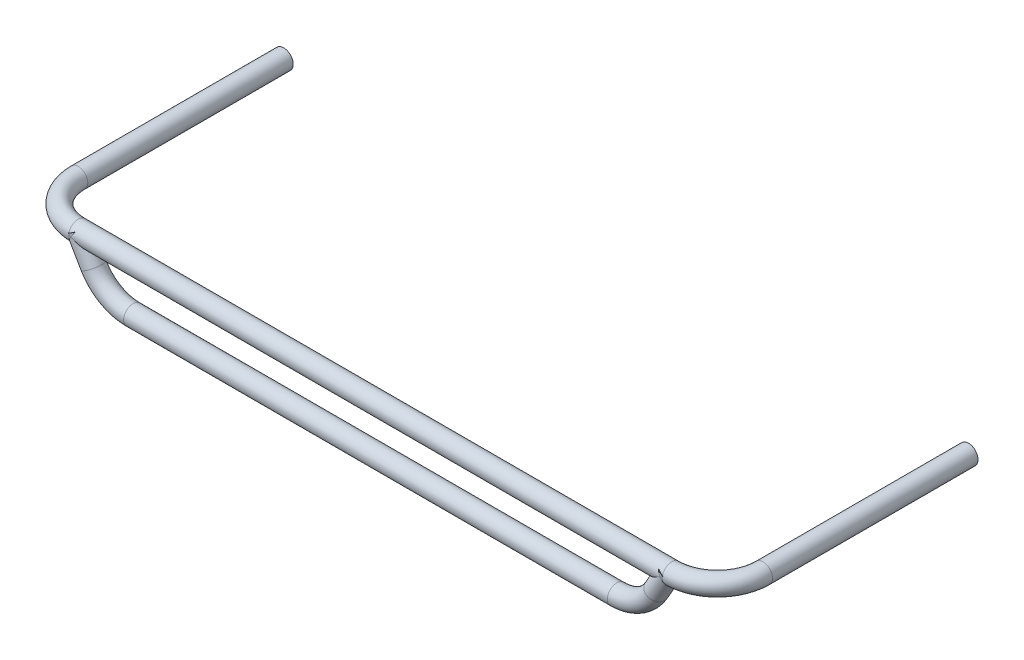
ISO-10303-21;
HEADER;
FILE_DESCRIPTION(('STEP AP214'),'2;1');
FILE_NAME('part.step','',(''),(''),'','','');
FILE_SCHEMA(('AUTOMOTIVE_DESIGN { 1 0 10303 214 1 1 1 1 }'));
ENDSEC;
DATA;
#1=APPLICATION_CONTEXT('core data for automotive mechanical design processes');
#2=APPLICATION_PROTOCOL_DEFINITION('international standard','automotive_design',2000,#1);
#3=PRODUCT_CONTEXT('',#1,'mechanical');
#4=PRODUCT('Part','Part','',(#3));
#5=PRODUCT_RELATED_PRODUCT_CATEGORY('part','',(#4));
#6=PRODUCT_DEFINITION_FORMATION('','',#4);
#7=PRODUCT_DEFINITION_CONTEXT('part definition',#1,'design');
#8=PRODUCT_DEFINITION('design','',#6,#7);
#9=PRODUCT_DEFINITION_SHAPE('','',#8);
#10=(LENGTH_UNIT() NAMED_UNIT(*) SI_UNIT(.MILLI.,.METRE.));
#11=(NAMED_UNIT(*) PLANE_ANGLE_UNIT() SI_UNIT($,.RADIAN.));
#12=(NAMED_UNIT(*) SI_UNIT($,.STERADIAN.) SOLID_ANGLE_UNIT());
#13=UNCERTAINTY_MEASURE_WITH_UNIT(LENGTH_MEASURE(1.E-05),#10,'distance_accuracy_value','');
#14=(GEOMETRIC_REPRESENTATION_CONTEXT(3) GLOBAL_UNCERTAINTY_ASSIGNED_CONTEXT((#13)) GLOBAL_UNIT_ASSIGNED_CONTEXT((#10,
#11,#12)) REPRESENTATION_CONTEXT('',''));
#15=CARTESIAN_POINT('',(0.,0.,0.));
#16=DIRECTION('',(0.,0.,1.));
#17=DIRECTION('',(1.,0.,0.));
#18=AXIS2_PLACEMENT_3D('',#15,#16,#17);
#19=CARTESIAN_POINT('',(-260.,0.,140.));
#20=DIRECTION('',(1.,0.,0.));
#21=DIRECTION('',(0.,0.,-1.));
#22=AXIS2_PLACEMENT_3D('',#19,#20,#21);
#23=CYLINDRICAL_SURFACE('',#22,8.35000000000005);
#24=CARTESIAN_POINT('',(258.094010767585,0.,140.));
#25=DIRECTION('',(0.500000000000002,-0.866025403784438,0.));
#26=DIRECTION('',(0.866025403784438,0.500000000000002,0.));
#27=AXIS2_PLACEMENT_3D('',#24,#25,#26);
#28=ELLIPSE('',#27,16.6999999999999,8.35);
#29=CARTESIAN_POINT('',(259.999999999976,1.10042339639402,131.722828481379));
#30=VERTEX_POINT('',#29);
#31=CARTESIAN_POINT('',(258.094010767585,0.,131.65));
#32=VERTEX_POINT('',#31);
#33=EDGE_CURVE('E141',#30,#32,#28,.F.);
#34=ORIENTED_EDGE('',*,*,#33,.F.);
#35=CARTESIAN_POINT('',(260.,0.,140.));
#36=DIRECTION('',(-1.,0.,0.));
#37=DIRECTION('',(0.,0.,1.));
#38=AXIS2_PLACEMENT_3D('',#35,#36,#37);
#39=CIRCLE('',#38,8.35000000000005);
#40=CARTESIAN_POINT('',(260.,-3.30127018922277,132.330311926959));
#41=VERTEX_POINT('',#40);
#42=EDGE_CURVE('E272',#30,#41,#39,.T.);
#43=ORIENTED_EDGE('',*,*,#42,.T.);
#44=CARTESIAN_POINT('',(258.094010767585,0.,140.));
#45=DIRECTION('',(0.866025403784438,0.500000000000002,0.));
#46=DIRECTION('',(0.500000000000002,-0.866025403784438,0.));
#47=AXIS2_PLACEMENT_3D('',#44,#45,#46);
#48=ELLIPSE('',#47,9.64174949546676,8.35);
#49=EDGE_CURVE('E157',#32,#41,#48,.F.);
#50=ORIENTED_EDGE('',*,*,#49,.F.);
#51=EDGE_LOOP('',(#34,#43,#50));
#52=FACE_BOUND('',#51,.T.);
#53=ADVANCED_FACE('F36',(#52),#23,.T.);
#54=CARTESIAN_POINT('',(258.094010767585,0.,148.35));
#55=VERTEX_POINT('',#54);
#56=CARTESIAN_POINT('',(259.999999999995,1.10042339640476,148.27717151862));
#57=VERTEX_POINT('',#56);
#58=EDGE_CURVE('E169',#55,#57,#28,.F.);
#59=ORIENTED_EDGE('',*,*,#58,.F.);
#60=CARTESIAN_POINT('',(260.,-3.30127018922279,147.669688073041));
#61=VERTEX_POINT('',#60);
#62=EDGE_CURVE('E159',#61,#55,#48,.F.);
#63=ORIENTED_EDGE('',*,*,#62,.F.);
#64=EDGE_CURVE('E269',#61,#57,#39,.T.);
#65=ORIENTED_EDGE('',*,*,#64,.T.);
#66=EDGE_LOOP('',(#59,#63,#65));
#67=FACE_BOUND('',#66,.T.);
#68=ADVANCED_FACE('F311',(#67),#23,.T.);
#69=CARTESIAN_POINT('',(-258.094010767585,0.,140.));
#70=DIRECTION('',(0.499999999999998,0.86602540378444,0.));
#71=DIRECTION('',(0.86602540378444,-0.499999999999998,0.));
#72=AXIS2_PLACEMENT_3D('',#69,#70,#71);
#73=ELLIPSE('',#72,16.7000000000001,8.35000000000001);
#74=CARTESIAN_POINT('',(-258.094010767585,0.,148.35));
#75=VERTEX_POINT('',#74);
#76=CARTESIAN_POINT('',(-258.094010767585,0.,131.65));
#77=VERTEX_POINT('',#76);
#78=EDGE_CURVE('E56',#75,#77,#73,.T.);
#79=ORIENTED_EDGE('',*,*,#78,.T.);
#80=CARTESIAN_POINT('',(-258.094010767585,0.,140.));
#81=DIRECTION('',(0.86602540378444,-0.499999999999997,0.));
#82=DIRECTION('',(0.499999999999997,0.86602540378444,0.));
#83=AXIS2_PLACEMENT_3D('',#80,#81,#82);
#84=ELLIPSE('',#83,9.64174949546677,8.35000000000003);
#85=CARTESIAN_POINT('',(-255.575509316577,4.36217247208265,132.88003150823));
#86=VERTEX_POINT('',#85);
#87=EDGE_CURVE('E235',#86,#77,#84,.F.);
#88=ORIENTED_EDGE('',*,*,#87,.F.);
#89=CARTESIAN_POINT('',(-263.131013669602,0.,140.));
#90=DIRECTION('',(-0.500000000000005,0.866025403784436,0.));
#91=DIRECTION('',(0.866025403784436,0.500000000000005,0.));
#92=AXIS2_PLACEMENT_3D('',#89,#90,#91);
#93=ELLIPSE('',#92,16.6999999999999,8.35000000000005);
#94=CARTESIAN_POINT('',(-260.,1.80769158498116,131.848021642964));
#95=VERTEX_POINT('',#94);
#96=EDGE_CURVE('E248',#86,#95,#93,.T.);
#97=ORIENTED_EDGE('',*,*,#96,.T.);
#98=CARTESIAN_POINT('',(-260.,0.,140.));
#99=DIRECTION('',(-1.,0.,0.));
#100=DIRECTION('',(0.,0.,1.));
#101=AXIS2_PLACEMENT_3D('',#98,#99,#100);
#102=CIRCLE('',#101,8.35000000000005);
#103=CARTESIAN_POINT('',(-260.,1.80769158498116,148.151978357036));
#104=VERTEX_POINT('',#103);
#105=EDGE_CURVE('E268',#104,#95,#102,.T.);
#106=ORIENTED_EDGE('',*,*,#105,.F.);
#107=CARTESIAN_POINT('',(-255.575509316577,4.36217247208266,147.11996849177));
#108=VERTEX_POINT('',#107);
#109=EDGE_CURVE('E245',#104,#108,#93,.T.);
#110=ORIENTED_EDGE('',*,*,#109,.T.);
#111=EDGE_CURVE('E237',#75,#108,#84,.F.);
#112=ORIENTED_EDGE('',*,*,#111,.F.);
#113=EDGE_LOOP('',(#79,#88,#97,#106,#110,#112));
#114=FACE_BOUND('',#113,.T.);
#115=CARTESIAN_POINT('',(258.094010767585,0.,140.));
#116=DIRECTION('',(0.866025403784438,0.500000000000002,0.));
#117=DIRECTION('',(0.500000000000002,-0.866025403784438,0.));
#118=AXIS2_PLACEMENT_3D('',#115,#116,#117);
#119=ELLIPSE('',#118,9.64174949546676,8.35);
#120=CARTESIAN_POINT('',(255.575509316577,4.36217247208224,132.880031508229));
#121=VERTEX_POINT('',#120);
#122=EDGE_CURVE('E156',#32,#121,#119,.T.);
#123=ORIENTED_EDGE('',*,*,#122,.F.);
#124=CARTESIAN_POINT('',(258.094010767585,0.,140.));
#125=DIRECTION('',(0.500000000000002,-0.866025403784438,0.));
#126=DIRECTION('',(0.866025403784438,0.500000000000002,0.));
#127=AXIS2_PLACEMENT_3D('',#124,#125,#126);
#128=ELLIPSE('',#127,16.7,8.35000000000001);
#129=EDGE_CURVE('E155',#32,#55,#128,.F.);
#130=ORIENTED_EDGE('',*,*,#129,.T.);
#131=CARTESIAN_POINT('',(255.575509316577,4.36217247208215,147.119968491771));
#132=VERTEX_POINT('',#131);
#133=EDGE_CURVE('E146',#132,#55,#119,.T.);
#134=ORIENTED_EDGE('',*,*,#133,.F.);
#135=CARTESIAN_POINT('',(263.131013669602,0.,140.));
#136=DIRECTION('',(0.499999999999996,0.866025403784441,0.));
#137=DIRECTION('',(0.866025403784441,-0.499999999999996,0.));
#138=AXIS2_PLACEMENT_3D('',#135,#136,#137);
#139=ELLIPSE('',#138,16.7000000000002,8.35000000000005);
#140=CARTESIAN_POINT('',(260.,1.80769158498089,148.151978357036));
#141=VERTEX_POINT('',#140);
#142=EDGE_CURVE('E131',#132,#141,#139,.T.);
#143=ORIENTED_EDGE('',*,*,#142,.T.);
#144=CARTESIAN_POINT('',(260.,1.80769158498089,131.848021642964));
#145=VERTEX_POINT('',#144);
#146=EDGE_CURVE('E273',#141,#145,#39,.T.);
#147=ORIENTED_EDGE('',*,*,#146,.T.);
#148=EDGE_CURVE('E140',#145,#121,#139,.T.);
#149=ORIENTED_EDGE('',*,*,#148,.T.);
#150=EDGE_LOOP('',(#123,#130,#134,#143,#147,#149));
#151=FACE_BOUND('',#150,.T.);
#152=ADVANCED_FACE('F154',(#114,#151),#23,.T.);
#153=CARTESIAN_POINT('',(260.,0.,100.));
#154=DIRECTION('',(0.,1.,0.));
#155=DIRECTION('',(0.,0.,1.));
#156=AXIS2_PLACEMENT_3D('',#153,#154,#155);
#157=TOROIDAL_SURFACE('',#156,40.,8.35000000000005);
#158=CARTESIAN_POINT('',(300.,0.,99.9999999999999));
#159=DIRECTION('',(0.,0.,1.));
#160=DIRECTION('',(1.,0.,0.));
#161=AXIS2_PLACEMENT_3D('',#158,#159,#160);
#162=CIRCLE('',#161,8.35000000000005);
#163=CARTESIAN_POINT('',(308.35,0.,99.9999999999999));
#164=VERTEX_POINT('',#163);
#165=EDGE_CURVE('E274',#164,#164,#162,.T.);
#166=ORIENTED_EDGE('',*,*,#165,.T.);
#167=EDGE_LOOP('',(#166));
#168=FACE_BOUND('',#167,.T.);
#169=CARTESIAN_POINT('',(259.9998,-3.30092378193599,132.330162831237));
#170=CARTESIAN_POINT('',(260.127191042265,-3.52194896573577,132.425241184169));
#171=CARTESIAN_POINT('',(260.251656278802,-3.7405873813507,132.529953859329));
#172=CARTESIAN_POINT('',(260.494955624184,-4.17100374883151,132.758747523321));
#173=CARTESIAN_POINT('',(260.613785352044,-4.38277632408056,132.882843268724));
#174=CARTESIAN_POINT('',(260.846802336749,-4.79874757524487,133.151467128787));
#175=CARTESIAN_POINT('',(260.960942892945,-5.002868829025,133.296156233047));
#176=CARTESIAN_POINT('',(261.182895743755,-5.39946088372897,133.604988661169));
#177=CARTESIAN_POINT('',(261.290709380227,-5.59193415531237,133.769127837462));
#178=CARTESIAN_POINT('',(261.499735660655,-5.96400988069852,134.117421014595));
#179=CARTESIAN_POINT('',(261.600911311754,-6.1435406786224,134.301674066792));
#180=CARTESIAN_POINT('',(261.794968483451,-6.48632252344461,134.688841917994));
#181=CARTESIAN_POINT('',(261.887849277702,-6.64957214481551,134.891758348119));
#182=CARTESIAN_POINT('',(262.06376042126,-6.9568858981134,135.314439468037));
#183=CARTESIAN_POINT('',(262.14682370751,-7.10101439146055,135.534143500346));
#184=CARTESIAN_POINT('',(262.302139027113,-7.3684429881502,135.98946784453));
#185=CARTESIAN_POINT('',(262.374393456754,-7.49174770883678,136.225084611742));
#186=CARTESIAN_POINT('',(262.497635276804,-7.69999139493781,136.676705268877));
#187=CARTESIAN_POINT('',(262.550181471088,-7.78787650773961,136.890929820182));
#188=CARTESIAN_POINT('',(262.64546072037,-7.94543811651955,137.328075966104));
#189=CARTESIAN_POINT('',(262.688195142735,-8.01511714988097,137.5509963438));
#190=CARTESIAN_POINT('',(262.76314145715,-8.13531904491372,138.003668991271));
#191=CARTESIAN_POINT('',(262.795353527362,-8.18584223093298,138.233421145301));
#192=CARTESIAN_POINT('',(262.84867590119,-8.26706237333086,138.69766551197));
#193=CARTESIAN_POINT('',(262.869787250017,-8.29776119637363,138.932157276183));
#194=CARTESIAN_POINT('',(262.898661018409,-8.33652083501706,139.375306170574));
#195=CARTESIAN_POINT('',(262.907722074794,-8.34685756587417,139.583683947074));
#196=CARTESIAN_POINT('',(262.916789533394,-8.35191293856676,140.000821222853));
#197=CARTESIAN_POINT('',(262.916796403656,-8.34663238773406,140.209580701842));
#198=CARTESIAN_POINT('',(262.907725107887,-8.32063930912101,140.625864727206));
#199=CARTESIAN_POINT('',(262.898649832772,-8.29993169242908,140.833389645405));
#200=CARTESIAN_POINT('',(262.871505334329,-8.24345502241763,141.245783819159));
#201=CARTESIAN_POINT('',(262.853435931941,-8.20768566924366,141.450653021758));
#202=CARTESIAN_POINT('',(262.808892291563,-8.12236149948406,141.852778396806));
#203=CARTESIAN_POINT('',(262.782570317973,-8.07305829388492,142.050105038437));
#204=CARTESIAN_POINT('',(262.72170008017,-7.96101661456943,142.439671105707));
#205=CARTESIAN_POINT('',(262.687149118931,-7.89827373672,142.631908840471));
#206=CARTESIAN_POINT('',(262.610181964994,-7.76007944570321,143.010100839834));
#207=CARTESIAN_POINT('',(262.567766795604,-7.68462968610186,143.196055918231));
#208=CARTESIAN_POINT('',(262.475476331206,-7.52178063584517,143.560750075568));
#209=CARTESIAN_POINT('',(262.425600326005,-7.43438020768037,143.739488465497));
#210=CARTESIAN_POINT('',(262.315420869052,-7.24247392051692,144.100100189879));
#211=CARTESIAN_POINT('',(262.254653809602,-7.13723051122845,144.28143938806));
#212=CARTESIAN_POINT('',(262.125781457474,-6.91512076681364,144.634106709842));
#213=CARTESIAN_POINT('',(262.057675878997,-6.79825397902676,144.805434443143));
#214=CARTESIAN_POINT('',(261.914705142867,-6.55381369596996,145.137454732863));
#215=CARTESIAN_POINT('',(261.839835986527,-6.42623387024047,145.298140899322));
#216=CARTESIAN_POINT('',(261.684010968886,-6.16138929147492,145.608181774586));
#217=CARTESIAN_POINT('',(261.603054663618,-6.02412383206111,145.757535655272));
#218=CARTESIAN_POINT('',(261.426671065469,-5.72553543627891,146.059925310908));
#219=CARTESIAN_POINT('',(261.33062517603,-5.56321534885741,146.211616706949));
#220=CARTESIAN_POINT('',(261.132806526856,-5.22906968498815,146.499937748281));
#221=CARTESIAN_POINT('',(261.031034997739,-5.05724615125948,146.636570611579));
#222=CARTESIAN_POINT('',(260.822786166333,-4.7053170185714,146.894316258458));
#223=CARTESIAN_POINT('',(260.71631285065,-4.52521843090611,147.015441863155));
#224=CARTESIAN_POINT('',(260.499630195553,-4.15765355429414,147.241978684366));
#225=CARTESIAN_POINT('',(260.389422483129,-3.97019046835808,147.34739663899));
#226=CARTESIAN_POINT('',(260.231925928855,-3.70075015648765,147.485092128785));
#227=CARTESIAN_POINT('',(260.185692452482,-3.6214718389596,147.523968224745));
#228=CARTESIAN_POINT('',(260.0929467545,-3.46194331392836,147.598957625211));
#229=CARTESIAN_POINT('',(260.04643498341,-3.38169453339863,147.635074522245));
#230=CARTESIAN_POINT('',(259.9998,-3.30092377711153,147.669837169801));
#231=B_SPLINE_CURVE_WITH_KNOTS('',3,(#169,#170,#171,#172,#173,#174,#175,#176,#177,#178,#179,
#180,#181,#182,#183,#184,#185,#186,#187,#188,#189,#190,#191,#192,#193,#194,#195,#196,#197,#198,
#199,#200,#201,#202,#203,#204,#205,#206,#207,#208,#209,#210,#211,#212,#213,#214,#215,#216,#217,
#218,#219,#220,#221,#222,#223,#224,#225,#226,#227,#228,#229,#230),.UNSPECIFIED.,.F.,.F.,(4,2,2,
2,2,2,2,2,2,2,2,2,2,2,2,2,2,2,2,2,2,2,2,2,2,2,2,2,2,2,4),(0.,0.816644202569578,1.63391318441927,
2.45796326990165,3.28183794859808,4.10997034916927,4.93817519480829,5.76351747959598,
6.58867651674438,7.29998486718959,8.01119402956994,8.72239114917749,9.43352129261927,
10.0592497981726,10.6849459573983,11.310443016105,11.9359525280204,12.5505401258463,
13.1653294308083,13.780038794025,14.394806708368,15.0490025031375,15.7032237848734,
16.3578344113753,17.0124928283745,17.7378534341109,18.4630587285252,19.1876605103213,
19.9119505593477,20.2109235109294,20.5095003141807),.UNSPECIFIED.);
#232=EDGE_CURVE('E150',#41,#61,#231,.T.);
#233=ORIENTED_EDGE('',*,*,#232,.F.);
#234=ORIENTED_EDGE('',*,*,#42,.F.);
#235=CARTESIAN_POINT('',(266.171914337866,5.20703424042682,132.898486379266));
#236=CARTESIAN_POINT('',(266.044995583243,5.125140480757,132.855834457565));
#237=CARTESIAN_POINT('',(265.917953723087,5.04267332498569,132.81467552516));
#238=CARTESIAN_POINT('',(265.663671731707,4.87671159046088,132.735169112735));
#239=CARTESIAN_POINT('',(265.536431612191,4.79321707050778,132.696821472677));
#240=CARTESIAN_POINT('',(265.154550962678,4.54141470140999,132.585751990572));
#241=CARTESIAN_POINT('',(264.899663455263,4.37173198811169,132.516974715743));
#242=CARTESIAN_POINT('',(264.390106447177,4.03001088065038,132.388961842688));
#243=CARTESIAN_POINT('',(264.135438119,3.85797980576845,132.329701766556));
#244=CARTESIAN_POINT('',(263.625621901318,3.51190297257161,132.21957733354));
#245=CARTESIAN_POINT('',(263.370473962797,3.33785699777562,132.168713887919));
#246=CARTESIAN_POINT('',(262.859655861113,2.98872068684098,132.074664334915));
#247=CARTESIAN_POINT('',(262.603985975157,2.81363084075826,132.031474879489));
#248=CARTESIAN_POINT('',(262.091587536817,2.46345267424639,131.952141903428));
#249=CARTESIAN_POINT('',(261.834859078723,2.28836435501636,131.915997768519));
#250=CARTESIAN_POINT('',(261.447806211627,2.02695628214892,131.866638864178));
#251=CARTESIAN_POINT('',(261.318283605089,1.93990624712844,131.85097738658));
#252=CARTESIAN_POINT('',(261.058418370453,1.76678476468184,131.821239584164));
#253=CARTESIAN_POINT('',(260.928075799359,1.68071325037335,131.807163150413));
#254=CARTESIAN_POINT('',(260.666133758607,1.51016349571615,131.780531151409));
#255=CARTESIAN_POINT('',(260.534533967306,1.42568568048197,131.767975987239));
#256=CARTESIAN_POINT('',(260.269089812045,1.26005937847775,131.744319723871));
#257=CARTESIAN_POINT('',(260.13524488126,1.17891175084975,131.733218998298));
#258=CARTESIAN_POINT('',(259.9998,1.10030792951591,131.722813130617));
#259=B_SPLINE_CURVE_WITH_KNOTS('',3,(#235,#236,#237,#238,#239,#240,#241,#242,#243,#244,#245,
#246,#247,#248,#249,#250,#251,#252,#253,#254,#255,#256,#257,#258),.UNSPECIFIED.,.F.,.F.,(4,2,2,
2,2,2,2,2,2,2,2,4),(0.,0.470838275505046,0.94164972714375,1.88295125063081,2.82179160527936,
3.76073378285743,4.69926530321099,5.63771495729492,6.10822708882635,6.57870686489631,
7.04931041447464,7.52003461962662),.UNSPECIFIED.);
#260=CARTESIAN_POINT('',(260.594300431314,1.46457207098232,131.773887321154));
#261=VERTEX_POINT('',#260);
#262=EDGE_CURVE('E192',#261,#30,#259,.T.);
#263=ORIENTED_EDGE('',*,*,#262,.F.);
#264=CARTESIAN_POINT('',(261.660006873947,0.849286169451154,131.6498));
#265=CARTESIAN_POINT('',(261.5215613771,0.929217714323649,131.665246155481));
#266=CARTESIAN_POINT('',(261.383136375149,1.00913742646268,131.680938318111));
#267=CARTESIAN_POINT('',(261.106333437127,1.16894967724196,131.712846908121));
#268=CARTESIAN_POINT('',(260.967955500497,1.24884221620522,131.729063329032));
#269=CARTESIAN_POINT('',(260.691249165706,1.40859869308371,131.762053087903));
#270=CARTESIAN_POINT('',(260.552920767611,1.48846263095993,131.77882642662));
#271=CARTESIAN_POINT('',(260.276317966262,1.64815933277756,131.812974629736));
#272=CARTESIAN_POINT('',(260.138043563694,1.72799209632213,131.830349501555));
#273=CARTESIAN_POINT('',(259.9998,1.80780705503475,131.848047248542));
#274=B_SPLINE_CURVE_WITH_KNOTS('',3,(#264,#265,#266,#267,#268,#269,#270,#271,#272,#273),
.UNSPECIFIED.,.F.,.F.,(4,2,2,2,4),(0.,0.481822662771046,0.963639382559329,1.44545675708833,
1.92728007694289),.UNSPECIFIED.);
#275=EDGE_CURVE('E11',#261,#145,#274,.T.);
#276=ORIENTED_EDGE('',*,*,#275,.T.);
#277=ORIENTED_EDGE('',*,*,#146,.F.);
#278=CARTESIAN_POINT('',(259.9998,1.80780705503473,148.151952750415));
#279=CARTESIAN_POINT('',(260.551283888352,1.48940768364109,148.222537252253));
#280=CARTESIAN_POINT('',(261.105431979999,1.16947013375758,148.264477462689));
#281=CARTESIAN_POINT('',(262.210607219874,0.531396911514257,148.29175701192));
#282=CARTESIAN_POINT('',(262.761626458009,0.213265806048391,148.277520071161));
#283=CARTESIAN_POINT('',(263.860504764226,-0.421171879852514,148.19417048913));
#284=CARTESIAN_POINT('',(264.408363953192,-0.737478530080477,148.125059961211));
#285=CARTESIAN_POINT('',(265.501017932273,-1.36832259903369,147.931860936961));
#286=CARTESIAN_POINT('',(266.045757961555,-1.68282840157797,147.807359419213));
#287=CARTESIAN_POINT('',(266.584773614689,-1.99402923401237,147.655640536745));
#288=B_SPLINE_CURVE_WITH_KNOTS('',3,(#278,#279,#280,#281,#282,#283,#284,#285,#286,#287),
.UNSPECIFIED.,.F.,.F.,(4,2,2,2,4),(0.,1.92130810181969,3.82815239477574,5.73492325276476,
7.65615660033882),.UNSPECIFIED.);
#289=CARTESIAN_POINT('',(260.625730817424,1.44642572910105,148.219707765983));
#290=VERTEX_POINT('',#289);
#291=EDGE_CURVE('E49',#141,#290,#288,.T.);
#292=ORIENTED_EDGE('',*,*,#291,.T.);
#293=CARTESIAN_POINT('',(259.9998,1.10030792427644,148.277186869035));
#294=CARTESIAN_POINT('',(260.137533692097,1.17961416164348,148.266624643183));
#295=CARTESIAN_POINT('',(260.276233175012,1.2569917278287,148.254609572401));
#296=CARTESIAN_POINT('',(260.554836885181,1.40898042391529,148.227641246772));
#297=CARTESIAN_POINT('',(260.694740947238,1.48359192593899,148.212688388865));
#298=CARTESIAN_POINT('',(260.975045064314,1.63114996096998,148.179811447066));
#299=CARTESIAN_POINT('',(261.115445047655,1.70409672406565,148.161887776642));
#300=CARTESIAN_POINT('',(261.396438073984,1.84881727687671,148.123036490117));
#301=CARTESIAN_POINT('',(261.53703112391,1.92059102319192,148.102108763149));
#302=CARTESIAN_POINT('',(261.956805281519,2.13371371038262,148.035078248668));
#303=CARTESIAN_POINT('',(262.2358978232,2.27385845468615,147.984504785484));
#304=CARTESIAN_POINT('',(262.792539929029,2.55228065704097,147.871138309736));
#305=CARTESIAN_POINT('',(263.070089411378,2.69055801664478,147.808344655598));
#306=CARTESIAN_POINT('',(263.622703307696,2.9658569398328,147.670261268297));
#307=CARTESIAN_POINT('',(263.897767709359,3.10287849719789,147.594971473284));
#308=CARTESIAN_POINT('',(264.444519902901,3.3759691282788,147.431578973402));
#309=CARTESIAN_POINT('',(264.716207963667,3.51203827746096,147.34347729604));
#310=CARTESIAN_POINT('',(265.257181479649,3.78429380110857,147.153443623786));
#311=CARTESIAN_POINT('',(265.526438482664,3.92047480800455,147.051422588982));
#312=CARTESIAN_POINT('',(266.059763268496,4.19206963872183,146.833505083646));
#313=CARTESIAN_POINT('',(266.32382971068,4.32748325807615,146.717605081839));
#314=CARTESIAN_POINT('',(266.584773614689,4.46249790415611,146.59453942669));
#315=B_SPLINE_CURVE_WITH_KNOTS('',3,(#293,#294,#295,#296,#297,#298,#299,#300,#301,#302,#303,
#304,#305,#306,#307,#308,#309,#310,#311,#312,#313,#314),.UNSPECIFIED.,.F.,.F.,(4,2,2,2,2,2,2,2,
2,2,4),(0.,0.477792255968643,0.955519998908656,1.43318130885773,1.91086025186088,
2.85971104410952,3.80861166548191,4.75751698355812,5.70634624177295,6.66155753833251,
7.61701239107759),.UNSPECIFIED.);
#316=EDGE_CURVE('E149',#57,#290,#315,.T.);
#317=ORIENTED_EDGE('',*,*,#316,.F.);
#318=ORIENTED_EDGE('',*,*,#64,.F.);
#319=EDGE_LOOP('',(#233,#234,#263,#276,#277,#292,#317,#318));
#320=FACE_BOUND('',#319,.T.);
#321=ADVANCED_FACE('F171',(#168,#320),#157,.T.);
#322=CARTESIAN_POINT('',(-258.094010767585,0.,140.));
#323=DIRECTION('',(0.86602540378444,-0.499999999999997,0.));
#324=DIRECTION('',(0.499999999999997,0.86602540378444,0.));
#325=AXIS2_PLACEMENT_3D('',#322,#323,#324);
#326=ELLIPSE('',#325,9.64174949546677,8.35000000000003);
#327=CARTESIAN_POINT('',(-260.,-3.30127018920762,132.330311926952));
#328=VERTEX_POINT('',#327);
#329=EDGE_CURVE('E233',#328,#77,#326,.T.);
#330=ORIENTED_EDGE('',*,*,#329,.F.);
#331=CARTESIAN_POINT('',(-260.,1.10042339640756,131.722828481381));
#332=VERTEX_POINT('',#331);
#333=EDGE_CURVE('E267',#332,#328,#102,.T.);
#334=ORIENTED_EDGE('',*,*,#333,.F.);
#335=CARTESIAN_POINT('',(-258.094010767585,0.,140.));
#336=DIRECTION('',(0.499999999999997,0.86602540378444,0.));
#337=DIRECTION('',(0.86602540378444,-0.499999999999997,0.));
#338=AXIS2_PLACEMENT_3D('',#335,#336,#337);
#339=ELLIPSE('',#338,16.7000000000001,8.35000000000003);
#340=EDGE_CURVE('E244',#77,#332,#339,.T.);
#341=ORIENTED_EDGE('',*,*,#340,.F.);
#342=EDGE_LOOP('',(#330,#334,#341));
#343=FACE_BOUND('',#342,.T.);
#344=ADVANCED_FACE('F340',(#343),#23,.T.);
#345=CARTESIAN_POINT('',(-260.,-3.30127018922181,147.669688073042));
#346=VERTEX_POINT('',#345);
#347=EDGE_CURVE('E234',#75,#346,#326,.T.);
#348=ORIENTED_EDGE('',*,*,#347,.F.);
#349=CARTESIAN_POINT('',(-260.,1.10042339640726,148.277171518619));
#350=VERTEX_POINT('',#349);
#351=EDGE_CURVE('E208',#350,#75,#339,.T.);
#352=ORIENTED_EDGE('',*,*,#351,.F.);
#353=EDGE_CURVE('E264',#346,#350,#102,.T.);
#354=ORIENTED_EDGE('',*,*,#353,.F.);
#355=EDGE_LOOP('',(#348,#352,#354));
#356=FACE_BOUND('',#355,.T.);
#357=ADVANCED_FACE('F333',(#356),#23,.T.);
#358=CARTESIAN_POINT('',(-260.,0.,100.));
#359=DIRECTION('',(0.,1.,0.));
#360=DIRECTION('',(0.,0.,1.));
#361=AXIS2_PLACEMENT_3D('',#358,#359,#360);
#362=TOROIDAL_SURFACE('',#361,40.,8.35000000000005);
#363=CARTESIAN_POINT('',(-300.,0.,100.));
#364=DIRECTION('',(0.,0.,-1.));
#365=DIRECTION('',(-1.,0.,0.));
#366=AXIS2_PLACEMENT_3D('',#363,#364,#365);
#367=CIRCLE('',#366,8.35000000000005);
#368=CARTESIAN_POINT('',(-308.35,0.,100.));
#369=VERTEX_POINT('',#368);
#370=EDGE_CURVE('E261',#369,#369,#367,.T.);
#371=ORIENTED_EDGE('',*,*,#370,.F.);
#372=EDGE_LOOP('',(#371));
#373=FACE_BOUND('',#372,.T.);
#374=CARTESIAN_POINT('',(-259.9998,-3.30092377711059,147.669837169802));
#375=CARTESIAN_POINT('',(-260.125366136349,-3.51822662188957,147.576309654887));
#376=CARTESIAN_POINT('',(-260.249937940884,-3.73190140347772,147.472911640532));
#377=CARTESIAN_POINT('',(-260.495566734206,-4.15093733823754,147.246615447875));
#378=CARTESIAN_POINT('',(-260.61662200581,-4.35629444842791,147.123707926008));
#379=CARTESIAN_POINT('',(-260.854198103886,-4.75849343296023,146.858019191171));
#380=CARTESIAN_POINT('',(-260.970691384271,-4.95528420024177,146.715135739313));
#381=CARTESIAN_POINT('',(-261.197103342253,-5.33768442744202,146.410484283859));
#382=CARTESIAN_POINT('',(-261.307022938476,-5.5232954496764,146.248718928244));
#383=CARTESIAN_POINT('',(-261.519383162528,-5.88238629383566,145.90632610727));
#384=CARTESIAN_POINT('',(-261.62179670328,-6.05582209244336,145.725635544067));
#385=CARTESIAN_POINT('',(-261.817463193924,-6.38809713111295,145.346721522129));
#386=CARTESIAN_POINT('',(-261.910716953506,-6.54693766126193,145.148499616049));
#387=CARTESIAN_POINT('',(-262.086675431113,-6.84790118832491,144.736036411893));
#388=CARTESIAN_POINT('',(-262.169400963263,-6.99005712568748,144.521828092649));
#389=CARTESIAN_POINT('',(-262.323346549369,-7.25613121359424,144.078469046231));
#390=CARTESIAN_POINT('',(-262.394568237898,-7.38005195494231,143.849320448417));
#391=CARTESIAN_POINT('',(-262.518133481908,-7.59676645645933,143.400684245841));
#392=CARTESIAN_POINT('',(-262.57163723641,-7.69141236570413,143.182409726322));
#393=CARTESIAN_POINT('',(-262.667658117425,-7.8629928266226,142.736684516351));
#394=CARTESIAN_POINT('',(-262.710176856511,-7.93992997771791,142.509235178413));
#395=CARTESIAN_POINT('',(-262.783617587933,-8.07487882095823,142.047024387387));
#396=CARTESIAN_POINT('',(-262.814542739703,-8.13289566862046,141.81226494533));
#397=CARTESIAN_POINT('',(-262.8643510326,-8.22899823861207,141.337449948247));
#398=CARTESIAN_POINT('',(-262.88323555038,-8.26708623939611,141.097395001925));
#399=CARTESIAN_POINT('',(-262.907228865911,-8.3193692244433,140.642051641349));
#400=CARTESIAN_POINT('',(-262.913671493811,-8.33580718116312,140.427087770661));
#401=CARTESIAN_POINT('',(-262.916860872556,-8.35213000314854,139.996466641066));
#402=CARTESIAN_POINT('',(-262.913608441039,-8.3520162642694,139.780809442163));
#403=CARTESIAN_POINT('',(-262.897492823332,-8.33511413028954,139.350605999046));
#404=CARTESIAN_POINT('',(-262.884633803639,-8.31833296302093,139.136059313797));
#405=CARTESIAN_POINT('',(-262.849527416136,-8.26820973618193,138.709687667279));
#406=CARTESIAN_POINT('',(-262.827280183031,-8.23486791422885,138.497862667004));
#407=CARTESIAN_POINT('',(-262.775170543607,-8.15416743994915,138.089750180658));
#408=CARTESIAN_POINT('',(-262.745776398934,-8.1076491464649,137.893235733295));
#409=CARTESIAN_POINT('',(-262.679258801319,-8.00051317436939,137.505362142046));
#410=CARTESIAN_POINT('',(-262.642132868141,-7.93989097071383,137.31400467474));
#411=CARTESIAN_POINT('',(-262.560623567675,-7.80518468866647,136.93774125543));
#412=CARTESIAN_POINT('',(-262.516241826296,-7.73110362577514,136.752833869306));
#413=CARTESIAN_POINT('',(-262.42071815531,-7.57020384211445,136.390449502704));
#414=CARTESIAN_POINT('',(-262.369575621541,-7.48338398289742,136.212973188153));
#415=CARTESIAN_POINT('',(-262.25909917193,-7.29447813692971,135.860062453216));
#416=CARTESIAN_POINT('',(-262.199535483346,-7.19195276048018,135.68493539826));
#417=CARTESIAN_POINT('',(-262.074328727923,-6.97512309524086,135.344431234882));
#418=CARTESIAN_POINT('',(-262.008685520117,-6.86081853332016,135.179054352682));
#419=CARTESIAN_POINT('',(-261.871875501491,-6.62141360130904,134.858604937217));
#420=CARTESIAN_POINT('',(-261.800706025802,-6.49630801947478,134.703537443071));
#421=CARTESIAN_POINT('',(-261.653422166983,-6.23639600354734,134.404258937252));
#422=CARTESIAN_POINT('',(-261.577307341478,-6.10158870149403,134.260048899303));
#423=CARTESIAN_POINT('',(-261.411597162433,-5.80726287332384,133.966833216392));
#424=CARTESIAN_POINT('',(-261.321459695367,-5.64668777526585,133.819193971765));
#425=CARTESIAN_POINT('',(-261.136284679838,-5.31623569414414,133.538191861061));
#426=CARTESIAN_POINT('',(-261.041248006747,-5.1463603724757,133.404826457596));
#427=CARTESIAN_POINT('',(-260.846764509443,-4.79875037613498,133.15256025113));
#428=CARTESIAN_POINT('',(-260.747319700675,-4.62101929329984,133.033652928958));
#429=CARTESIAN_POINT('',(-260.544278301104,-4.25904751725017,132.810328001222));
#430=CARTESIAN_POINT('',(-260.440683174935,-4.07480912311576,132.705905341116));
#431=CARTESIAN_POINT('',(-260.280262239819,-3.79132190997625,132.558386784556));
#432=CARTESIAN_POINT('',(-260.224968832227,-3.6939243351315,132.509996892987));
#433=CARTESIAN_POINT('',(-260.11326405236,-3.49814563338547,132.417157093618));
#434=CARTESIAN_POINT('',(-260.056854646622,-3.39976636578908,132.372700899947));
#435=CARTESIAN_POINT('',(-259.9998,-3.30092378193527,132.330162831237));
#436=B_SPLINE_CURVE_WITH_KNOTS('',3,(#374,#375,#376,#377,#378,#379,#380,#381,#382,#383,#384,
#385,#386,#387,#388,#389,#390,#391,#392,#393,#394,#395,#396,#397,#398,#399,#400,#401,#402,#403,
#404,#405,#406,#407,#408,#409,#410,#411,#412,#413,#414,#415,#416,#417,#418,#419,#420,#421,#422,
#423,#424,#425,#426,#427,#428,#429,#430,#431,#432,#433,#434,#435),.UNSPECIFIED.,.F.,.F.,(4,2,2,
2,2,2,2,2,2,2,2,2,2,2,2,2,2,2,2,2,2,2,2,2,2,2,2,2,2,2,4),(0.,0.803349496068952,1.60708490251283,
2.41509572361747,3.22299336585431,4.03367593216953,4.84428677255554,5.65326929653111,
6.46213677140561,7.19268042642948,7.92311677840387,8.65335393009554,9.38350757590216,
10.0297423070947,10.6759225393619,11.3218226777937,11.9677135489219,12.5792320638034,
13.1909470471585,13.8025251424612,14.414157926934,15.0479678062733,15.6817923854432,
16.3159245275708,16.9501134727465,17.6574732444603,18.3647070628951,19.0716207965222,
19.7782872228244,20.144239600987,20.5095962252317),.UNSPECIFIED.);
#437=EDGE_CURVE('E226',#346,#328,#436,.T.);
#438=ORIENTED_EDGE('',*,*,#437,.F.);
#439=ORIENTED_EDGE('',*,*,#353,.T.);
#440=CARTESIAN_POINT('',(-266.584773614689,4.46249790415592,146.59453942669));
#441=CARTESIAN_POINT('',(-266.32382971068,4.32748325807597,146.717605081839));
#442=CARTESIAN_POINT('',(-266.059763268497,4.19206963872164,146.833505083646));
#443=CARTESIAN_POINT('',(-265.526438482665,3.92047480800433,147.051422588983));
#444=CARTESIAN_POINT('',(-265.257181479649,3.78429380110833,147.153443623787));
#445=CARTESIAN_POINT('',(-264.716207963667,3.51203827746071,147.34347729604));
#446=CARTESIAN_POINT('',(-264.444519902901,3.37596912827855,147.431578973402));
#447=CARTESIAN_POINT('',(-263.897767709359,3.10287849719762,147.594971473284));
#448=CARTESIAN_POINT('',(-263.622703307696,2.96585693983251,147.670261268297));
#449=CARTESIAN_POINT('',(-263.070089411378,2.69055801664446,147.808344655598));
#450=CARTESIAN_POINT('',(-262.79253992903,2.55228065704063,147.871138309736));
#451=CARTESIAN_POINT('',(-262.2358978232,2.27385845468578,147.984504785484));
#452=CARTESIAN_POINT('',(-261.956805281519,2.13371371038224,148.035078248668));
#453=CARTESIAN_POINT('',(-261.53703112391,1.92059102319149,148.102108763149));
#454=CARTESIAN_POINT('',(-261.396438073985,1.84881727687626,148.123036490117));
#455=CARTESIAN_POINT('',(-261.115445047655,1.70409672406515,148.161887776642));
#456=CARTESIAN_POINT('',(-260.975045064314,1.63114996096947,148.179811447066));
#457=CARTESIAN_POINT('',(-260.694740947238,1.48359192593843,148.212688388866));
#458=CARTESIAN_POINT('',(-260.554836885181,1.40898042391471,148.227641246772));
#459=CARTESIAN_POINT('',(-260.276233175012,1.25699172782812,148.254609572401));
#460=CARTESIAN_POINT('',(-260.137533692097,1.17961416164293,148.266624643183));
#461=CARTESIAN_POINT('',(-259.9998,1.10030792427594,148.277186869035));
#462=B_SPLINE_CURVE_WITH_KNOTS('',3,(#440,#441,#442,#443,#444,#445,#446,#447,#448,#449,#450,
#451,#452,#453,#454,#455,#456,#457,#458,#459,#460,#461),.UNSPECIFIED.,.F.,.F.,(4,2,2,2,2,2,2,2,
2,2,4),(0.,0.955454852745137,1.91066614930471,2.85949540751959,3.80840072559593,
4.75730134696839,5.70615213921705,6.18383108222028,6.66149239216943,7.13922013510951,
7.61701239107812),.UNSPECIFIED.);
#463=CARTESIAN_POINT('',(-260.625730817398,1.44642572911598,148.219707765989));
#464=VERTEX_POINT('',#463);
#465=EDGE_CURVE('E201',#464,#350,#462,.T.);
#466=ORIENTED_EDGE('',*,*,#465,.F.);
#467=CARTESIAN_POINT('',(-266.584773614689,-1.99402923401245,147.655640536745));
#468=CARTESIAN_POINT('',(-266.045757961555,-1.68282840157801,147.807359419212));
#469=CARTESIAN_POINT('',(-265.501017932273,-1.36832259903371,147.931860936961));
#470=CARTESIAN_POINT('',(-264.408363953193,-0.737478530080442,148.125059961211));
#471=CARTESIAN_POINT('',(-263.860504764226,-0.421171879852452,148.19417048913));
#472=CARTESIAN_POINT('',(-262.761626458009,0.213265806048509,148.277520071161));
#473=CARTESIAN_POINT('',(-262.210607219874,0.531396911514403,148.29175701192));
#474=CARTESIAN_POINT('',(-261.105431979999,1.16947013375779,148.264477462689));
#475=CARTESIAN_POINT('',(-260.551283888352,1.48940768364132,148.222537252253));
#476=CARTESIAN_POINT('',(-259.9998,1.80780705503499,148.151952750415));
#477=B_SPLINE_CURVE_WITH_KNOTS('',3,(#467,#468,#469,#470,#471,#472,#473,#474,#475,#476),
.UNSPECIFIED.,.F.,.F.,(4,2,2,2,4),(0.,1.92123334757416,3.82800420556332,5.7348484985195,
7.65615660033934),.UNSPECIFIED.);
#478=EDGE_CURVE('E279',#464,#104,#477,.T.);
#479=ORIENTED_EDGE('',*,*,#478,.T.);
#480=ORIENTED_EDGE('',*,*,#105,.T.);
#481=CARTESIAN_POINT('',(-259.9998,1.807807055035,131.848047248542));
#482=CARTESIAN_POINT('',(-260.138043563694,1.72799209632232,131.830349501555));
#483=CARTESIAN_POINT('',(-260.276317966262,1.6481593327777,131.812974629736));
#484=CARTESIAN_POINT('',(-260.552920767612,1.48846263096001,131.77882642662));
#485=CARTESIAN_POINT('',(-260.691249165706,1.40859869308376,131.762053087903));
#486=CARTESIAN_POINT('',(-260.967955500498,1.24884221620522,131.729063329032));
#487=CARTESIAN_POINT('',(-261.106333437128,1.16894967724194,131.712846908121));
#488=CARTESIAN_POINT('',(-261.38313637515,1.0091374264626,131.680938318111));
#489=CARTESIAN_POINT('',(-261.521561377101,0.929217714323521,131.665246155481));
#490=CARTESIAN_POINT('',(-261.660006873947,0.84928616945098,131.6498));
#491=B_SPLINE_CURVE_WITH_KNOTS('',3,(#481,#482,#483,#484,#485,#486,#487,#488,#489,#490),
.UNSPECIFIED.,.F.,.F.,(4,2,2,2,4),(0.,0.481823319854779,0.963640694383962,1.44545741417243,
1.92728007694368),.UNSPECIFIED.);
#492=CARTESIAN_POINT('',(-260.594300431337,1.46457207096946,131.773887321151));
#493=VERTEX_POINT('',#492);
#494=EDGE_CURVE('E286',#95,#493,#491,.T.);
#495=ORIENTED_EDGE('',*,*,#494,.T.);
#496=CARTESIAN_POINT('',(-259.9998,1.10030792951552,131.722813130617));
#497=CARTESIAN_POINT('',(-260.13524488126,1.17891175084942,131.733218998298));
#498=CARTESIAN_POINT('',(-260.269089812045,1.26005937847744,131.744319723871));
#499=CARTESIAN_POINT('',(-260.534533967306,1.42568568048167,131.767975987239));
#500=CARTESIAN_POINT('',(-260.666133758607,1.51016349571584,131.780531151409));
#501=CARTESIAN_POINT('',(-260.928075799359,1.68071325037304,131.807163150413));
#502=CARTESIAN_POINT('',(-261.058418370453,1.76678476468153,131.821239584164));
#503=CARTESIAN_POINT('',(-261.318283605089,1.93990624712816,131.85097738658));
#504=CARTESIAN_POINT('',(-261.447806211627,2.02695628214867,131.866638864178));
#505=CARTESIAN_POINT('',(-261.834859078723,2.28836435501615,131.915997768519));
#506=CARTESIAN_POINT('',(-262.091587536817,2.46345267424617,131.952141903428));
#507=CARTESIAN_POINT('',(-262.603985975157,2.81363084075809,132.031474879489));
#508=CARTESIAN_POINT('',(-262.859655861113,2.98872068684086,132.074664334915));
#509=CARTESIAN_POINT('',(-263.370473962797,3.33785699777557,132.168713887919));
#510=CARTESIAN_POINT('',(-263.625621901318,3.51190297257157,132.21957733354));
#511=CARTESIAN_POINT('',(-264.135438119,3.85797980576844,132.329701766556));
#512=CARTESIAN_POINT('',(-264.390106447177,4.03001088065039,132.388961842688));
#513=CARTESIAN_POINT('',(-264.899663455263,4.37173198811174,132.516974715743));
#514=CARTESIAN_POINT('',(-265.154550962679,4.54141470141005,132.585751990572));
#515=CARTESIAN_POINT('',(-265.536431612192,4.79321707050787,132.696821472677));
#516=CARTESIAN_POINT('',(-265.663671731708,4.87671159046097,132.735169112735));
#517=CARTESIAN_POINT('',(-265.917953723088,5.04267332498579,132.81467552516));
#518=CARTESIAN_POINT('',(-266.044995583244,5.12514048075712,132.855834457564));
#519=CARTESIAN_POINT('',(-266.171914337866,5.20703424042694,132.898486379266));
#520=B_SPLINE_CURVE_WITH_KNOTS('',3,(#496,#497,#498,#499,#500,#501,#502,#503,#504,#505,#506,
#507,#508,#509,#510,#511,#512,#513,#514,#515,#516,#517,#518,#519),.UNSPECIFIED.,.F.,.F.,(4,2,2,
2,2,2,2,2,2,2,2,4),(0.,0.470724205151971,0.941327754730348,1.41180753080032,1.88231966233183,
2.82076931641576,3.7593008367696,4.69824301434772,5.63708336899641,6.57838489248354,
7.04919634412225,7.52003461962736),.UNSPECIFIED.);
#521=EDGE_CURVE('E236',#332,#493,#520,.T.);
#522=ORIENTED_EDGE('',*,*,#521,.F.);
#523=ORIENTED_EDGE('',*,*,#333,.T.);
#524=EDGE_LOOP('',(#438,#439,#466,#479,#480,#495,#522,#523));
#525=FACE_BOUND('',#524,.T.);
#526=ADVANCED_FACE('F210',(#373,#525),#362,.T.);
#527=CARTESIAN_POINT('',(-300.,0.,0.));
#528=DIRECTION('',(0.,0.,1.));
#529=DIRECTION('',(1.,0.,0.));
#530=AXIS2_PLACEMENT_3D('',#527,#528,#529);
#531=CYLINDRICAL_SURFACE('',#530,8.35000000000005);
#532=ORIENTED_EDGE('',*,*,#370,.T.);
#533=EDGE_LOOP('',(#532));
#534=FACE_BOUND('',#533,.T.);
#535=CARTESIAN_POINT('',(-300.,0.,-80.));
#536=DIRECTION('',(0.,0.,-1.));
#537=DIRECTION('',(-1.,0.,0.));
#538=AXIS2_PLACEMENT_3D('',#535,#536,#537);
#539=CIRCLE('',#538,8.35000000000005);
#540=CARTESIAN_POINT('',(-308.35,0.,-80.));
#541=VERTEX_POINT('',#540);
#542=EDGE_CURVE('E317',#541,#541,#539,.T.);
#543=ORIENTED_EDGE('',*,*,#542,.F.);
#544=EDGE_LOOP('',(#543));
#545=FACE_BOUND('',#544,.T.);
#546=ADVANCED_FACE('F325',(#534,#545),#531,.T.);
#547=CARTESIAN_POINT('',(300.,0.,100.));
#548=DIRECTION('',(0.,0.,-1.));
#549=DIRECTION('',(-1.,0.,0.));
#550=AXIS2_PLACEMENT_3D('',#547,#548,#549);
#551=CYLINDRICAL_SURFACE('',#550,8.35000000000005);
#552=ORIENTED_EDGE('',*,*,#165,.F.);
#553=EDGE_LOOP('',(#552));
#554=FACE_BOUND('',#553,.T.);
#555=CARTESIAN_POINT('',(300.,0.,-80.));
#556=DIRECTION('',(0.,0.,-1.));
#557=DIRECTION('',(-1.,0.,0.));
#558=AXIS2_PLACEMENT_3D('',#555,#556,#557);
#559=CIRCLE('',#558,8.35000000000005);
#560=CARTESIAN_POINT('',(291.65,0.,-80.));
#561=VERTEX_POINT('',#560);
#562=EDGE_CURVE('E315',#561,#561,#559,.T.);
#563=ORIENTED_EDGE('',*,*,#562,.F.);
#564=EDGE_LOOP('',(#563));
#565=FACE_BOUND('',#564,.T.);
#566=ADVANCED_FACE('F38',(#554,#565),#551,.T.);
#567=CARTESIAN_POINT('',(252.853261493089,-9.07724401315638,140.));
#568=DIRECTION('',(-0.499999999999997,-0.86602540378444,0.));
#569=DIRECTION('',(0.86602540378444,-0.499999999999997,0.));
#570=AXIS2_PLACEMENT_3D('',#567,#568,#569);
#571=CYLINDRICAL_SURFACE('',#570,8.34999999999998);
#572=CARTESIAN_POINT('',(246.547005383793,-19.9999999999999,140.));
#573=DIRECTION('',(-0.499999999999996,-0.866025403784441,0.));
#574=DIRECTION('',(0.866025403784441,-0.499999999999996,0.));
#575=AXIS2_PLACEMENT_3D('',#572,#573,#574);
#576=CIRCLE('',#575,8.34999999999998);
#577=CARTESIAN_POINT('',(253.778317505393,-24.1749999999998,140.));
#578=VERTEX_POINT('',#577);
#579=EDGE_CURVE('E249',#578,#578,#576,.T.);
#580=ORIENTED_EDGE('',*,*,#579,.F.);
#581=EDGE_LOOP('',(#580));
#582=FACE_BOUND('',#581,.T.);
#583=ORIENTED_EDGE('',*,*,#129,.F.);
#584=ORIENTED_EDGE('',*,*,#49,.T.);
#585=ORIENTED_EDGE('',*,*,#232,.T.);
#586=ORIENTED_EDGE('',*,*,#62,.T.);
#587=EDGE_LOOP('',(#583,#584,#585,#586));
#588=FACE_BOUND('',#587,.T.);
#589=ADVANCED_FACE('F220',(#582,#588),#571,.T.);
#590=CARTESIAN_POINT('',(-246.547005383792,-20.0000000000001,140.));
#591=DIRECTION('',(-0.500000000000004,0.866025403784436,0.));
#592=DIRECTION('',(-0.866025403784436,-0.500000000000004,0.));
#593=AXIS2_PLACEMENT_3D('',#590,#591,#592);
#594=CYLINDRICAL_SURFACE('',#593,8.34999999999998);
#595=CARTESIAN_POINT('',(-246.547005383792,-20.0000000000001,140.));
#596=DIRECTION('',(-0.500000000000005,0.866025403784436,0.));
#597=DIRECTION('',(-0.866025403784436,-0.500000000000005,0.));
#598=AXIS2_PLACEMENT_3D('',#595,#596,#597);
#599=CIRCLE('',#598,8.34999999999998);
#600=CARTESIAN_POINT('',(-253.778317505392,-24.1750000000002,140.));
#601=VERTEX_POINT('',#600);
#602=EDGE_CURVE('E258',#601,#601,#599,.T.);
#603=ORIENTED_EDGE('',*,*,#602,.T.);
#604=EDGE_LOOP('',(#603));
#605=FACE_BOUND('',#604,.T.);
#606=ORIENTED_EDGE('',*,*,#78,.F.);
#607=ORIENTED_EDGE('',*,*,#347,.T.);
#608=ORIENTED_EDGE('',*,*,#437,.T.);
#609=ORIENTED_EDGE('',*,*,#329,.T.);
#610=EDGE_LOOP('',(#606,#607,#608,#609));
#611=FACE_BOUND('',#610,.T.);
#612=ADVANCED_FACE('F337',(#605,#611),#594,.T.);
#613=CARTESIAN_POINT('',(211.905989232415,0.,140.));
#614=DIRECTION('',(0.,0.,-1.));
#615=DIRECTION('',(-1.,0.,0.));
#616=AXIS2_PLACEMENT_3D('',#613,#614,#615);
#617=TOROIDAL_SURFACE('',#616,39.9999999999999,8.34999999999998);
#618=CARTESIAN_POINT('',(211.905989232415,-40.,140.));
#619=DIRECTION('',(-1.,0.,0.));
#620=DIRECTION('',(0.,-1.,0.));
#621=AXIS2_PLACEMENT_3D('',#618,#619,#620);
#622=CIRCLE('',#621,8.34999999999998);
#623=CARTESIAN_POINT('',(211.905989232415,-48.3499999999999,140.));
#624=VERTEX_POINT('',#623);
#625=EDGE_CURVE('E252',#624,#624,#622,.T.);
#626=CARTESIAN_POINT('',(211.905989232415,0.,140.));
#627=DIRECTION('',(0.,0.,-1.));
#628=DIRECTION('',(-1.,0.,0.));
#629=AXIS2_PLACEMENT_3D('',#626,#627,#628);
#630=CIRCLE('',#629,48.3499999999999);
#631=EDGE_CURVE('',#578,#624,#630,.T.);
#632=ORIENTED_EDGE('',*,*,#579,.T.);
#633=ORIENTED_EDGE('',*,*,#625,.F.);
#634=ORIENTED_EDGE('',*,*,#631,.T.);
#635=ORIENTED_EDGE('',*,*,#631,.F.);
#636=EDGE_LOOP('',(#632,#634,#633,#635));
#637=FACE_BOUND('',#636,.T.);
#638=ADVANCED_FACE('F379',(#637),#617,.T.);
#639=CARTESIAN_POINT('',(211.905989232415,-40.,140.));
#640=DIRECTION('',(-1.,0.,0.));
#641=DIRECTION('',(0.,-1.,0.));
#642=AXIS2_PLACEMENT_3D('',#639,#640,#641);
#643=CYLINDRICAL_SURFACE('',#642,8.34999999999998);
#644=CARTESIAN_POINT('',(-211.905989232415,-40.,140.));
#645=DIRECTION('',(-1.,0.,0.));
#646=DIRECTION('',(0.,-1.,0.));
#647=AXIS2_PLACEMENT_3D('',#644,#645,#646);
#648=CIRCLE('',#647,8.34999999999998);
#649=CARTESIAN_POINT('',(-211.905989232415,-48.35,140.));
#650=VERTEX_POINT('',#649);
#651=EDGE_CURVE('E255',#650,#650,#648,.T.);
#652=ORIENTED_EDGE('',*,*,#651,.F.);
#653=EDGE_LOOP('',(#652));
#654=FACE_BOUND('',#653,.T.);
#655=ORIENTED_EDGE('',*,*,#625,.T.);
#656=EDGE_LOOP('',(#655));
#657=FACE_BOUND('',#656,.T.);
#658=ADVANCED_FACE('F383',(#654,#657),#643,.T.);
#659=CARTESIAN_POINT('',(-211.905989232415,0.,140.));
#660=DIRECTION('',(0.,0.,-1.));
#661=DIRECTION('',(-1.,0.,0.));
#662=AXIS2_PLACEMENT_3D('',#659,#660,#661);
#663=TOROIDAL_SURFACE('',#662,40.,8.34999999999998);
#664=CARTESIAN_POINT('',(-211.905989232415,0.,140.));
#665=DIRECTION('',(0.,0.,-1.));
#666=DIRECTION('',(-1.,0.,0.));
#667=AXIS2_PLACEMENT_3D('',#664,#665,#666);
#668=CIRCLE('',#667,48.35);
#669=EDGE_CURVE('',#650,#601,#668,.T.);
#670=ORIENTED_EDGE('',*,*,#651,.T.);
#671=ORIENTED_EDGE('',*,*,#602,.F.);
#672=ORIENTED_EDGE('',*,*,#669,.T.);
#673=ORIENTED_EDGE('',*,*,#669,.F.);
#674=EDGE_LOOP('',(#670,#672,#671,#673));
#675=FACE_BOUND('',#674,.T.);
#676=ADVANCED_FACE('F378',(#675),#663,.T.);
#677=CARTESIAN_POINT('',(-243.631013669602,11.2583302491977,140.));
#678=DIRECTION('',(-0.500000000000005,0.866025403784436,0.));
#679=DIRECTION('',(-0.866025403784436,-0.500000000000005,0.));
#680=AXIS2_PLACEMENT_3D('',#677,#678,#679);
#681=PLANE('',#680);
#682=ORIENTED_EDGE('',*,*,#109,.F.);
#683=ORIENTED_EDGE('',*,*,#478,.F.);
#684=CARTESIAN_POINT('',(-259.353261493089,2.18108623604129,140.));
#685=DIRECTION('',(-0.500000000000005,0.866025403784436,0.));
#686=DIRECTION('',(-0.866025403784436,-0.500000000000005,0.));
#687=AXIS2_PLACEMENT_3D('',#684,#685,#686);
#688=CIRCLE('',#687,8.35000000000001);
#689=EDGE_CURVE('E198',#464,#108,#688,.T.);
#690=ORIENTED_EDGE('',*,*,#689,.T.);
#691=EDGE_LOOP('',(#682,#683,#690));
#692=FACE_BOUND('',#691,.T.);
#693=ADVANCED_FACE('F217',(#692),#681,.T.);
#694=CARTESIAN_POINT('',(-259.353261493089,2.18108623604129,140.));
#695=DIRECTION('',(0.500000000000005,-0.866025403784436,0.));
#696=DIRECTION('',(0.866025403784436,0.500000000000005,0.));
#697=AXIS2_PLACEMENT_3D('',#694,#695,#696);
#698=CYLINDRICAL_SURFACE('',#697,8.35000000000001);
#699=ORIENTED_EDGE('',*,*,#351,.T.);
#700=ORIENTED_EDGE('',*,*,#111,.T.);
#701=ORIENTED_EDGE('',*,*,#689,.F.);
#702=ORIENTED_EDGE('',*,*,#465,.T.);
#703=EDGE_LOOP('',(#699,#700,#701,#702));
#704=FACE_BOUND('',#703,.T.);
#705=ADVANCED_FACE('F213',(#704),#698,.T.);
#706=ORIENTED_EDGE('',*,*,#96,.F.);
#707=EDGE_CURVE('E200',#86,#493,#688,.T.);
#708=ORIENTED_EDGE('',*,*,#707,.T.);
#709=ORIENTED_EDGE('',*,*,#494,.F.);
#710=EDGE_LOOP('',(#706,#708,#709));
#711=FACE_BOUND('',#710,.T.);
#712=ADVANCED_FACE('F183',(#711),#681,.T.);
#713=ORIENTED_EDGE('',*,*,#87,.T.);
#714=ORIENTED_EDGE('',*,*,#340,.T.);
#715=ORIENTED_EDGE('',*,*,#521,.T.);
#716=ORIENTED_EDGE('',*,*,#707,.F.);
#717=EDGE_LOOP('',(#713,#714,#715,#716));
#718=FACE_BOUND('',#717,.T.);
#719=ADVANCED_FACE('F219',(#718),#698,.T.);
#720=CARTESIAN_POINT('',(243.631013669602,11.2583302491976,140.));
#721=DIRECTION('',(0.499999999999996,0.866025403784441,0.));
#722=DIRECTION('',(-0.866025403784441,0.499999999999996,0.));
#723=AXIS2_PLACEMENT_3D('',#720,#721,#722);
#724=PLANE('',#723);
#725=ORIENTED_EDGE('',*,*,#142,.F.);
#726=CARTESIAN_POINT('',(259.353261493089,2.18108623604124,140.));
#727=DIRECTION('',(0.499999999999996,0.866025403784441,0.));
#728=DIRECTION('',(-0.866025403784441,0.499999999999996,0.));
#729=AXIS2_PLACEMENT_3D('',#726,#727,#728);
#730=CIRCLE('',#729,8.34999999999995);
#731=EDGE_CURVE('E134',#132,#290,#730,.T.);
#732=ORIENTED_EDGE('',*,*,#731,.T.);
#733=ORIENTED_EDGE('',*,*,#291,.F.);
#734=EDGE_LOOP('',(#725,#732,#733));
#735=FACE_BOUND('',#734,.T.);
#736=ADVANCED_FACE('F133',(#735),#724,.T.);
#737=CARTESIAN_POINT('',(259.353261493089,2.18108623604124,140.));
#738=DIRECTION('',(-0.499999999999996,-0.866025403784441,0.));
#739=DIRECTION('',(0.866025403784441,-0.499999999999996,0.));
#740=AXIS2_PLACEMENT_3D('',#737,#738,#739);
#741=CYLINDRICAL_SURFACE('',#740,8.34999999999995);
#742=ORIENTED_EDGE('',*,*,#133,.T.);
#743=ORIENTED_EDGE('',*,*,#58,.T.);
#744=ORIENTED_EDGE('',*,*,#316,.T.);
#745=ORIENTED_EDGE('',*,*,#731,.F.);
#746=EDGE_LOOP('',(#742,#743,#744,#745));
#747=FACE_BOUND('',#746,.T.);
#748=ADVANCED_FACE('F145',(#747),#741,.T.);
#749=ORIENTED_EDGE('',*,*,#148,.F.);
#750=ORIENTED_EDGE('',*,*,#275,.F.);
#751=EDGE_CURVE('E151',#261,#121,#730,.T.);
#752=ORIENTED_EDGE('',*,*,#751,.T.);
#753=EDGE_LOOP('',(#749,#750,#752));
#754=FACE_BOUND('',#753,.T.);
#755=ADVANCED_FACE('F179',(#754),#724,.T.);
#756=ORIENTED_EDGE('',*,*,#262,.T.);
#757=ORIENTED_EDGE('',*,*,#33,.T.);
#758=ORIENTED_EDGE('',*,*,#122,.T.);
#759=ORIENTED_EDGE('',*,*,#751,.F.);
#760=EDGE_LOOP('',(#756,#757,#758,#759));
#761=FACE_BOUND('',#760,.T.);
#762=ADVANCED_FACE('F174',(#761),#741,.T.);
#763=CARTESIAN_POINT('',(300.,0.,-80.));
#764=DIRECTION('',(0.,0.,-1.));
#765=DIRECTION('',(-1.,0.,0.));
#766=AXIS2_PLACEMENT_3D('',#763,#764,#765);
#767=PLANE('',#766);
#768=ORIENTED_EDGE('',*,*,#562,.T.);
#769=EDGE_LOOP('',(#768));
#770=FACE_BOUND('',#769,.T.);
#771=ADVANCED_FACE('F178',(#770),#767,.T.);
#772=CARTESIAN_POINT('',(-300.,0.,-80.));
#773=DIRECTION('',(0.,0.,-1.));
#774=DIRECTION('',(-1.,0.,0.));
#775=AXIS2_PLACEMENT_3D('',#772,#773,#774);
#776=PLANE('',#775);
#777=ORIENTED_EDGE('',*,*,#542,.T.);
#778=EDGE_LOOP('',(#777));
#779=FACE_BOUND('',#778,.T.);
#780=ADVANCED_FACE('F323',(#779),#776,.T.);
#781=CLOSED_SHELL('',(#53,#68,#152,#321,#344,#357,#526,#546,#566,#589,#612,#638,#658,#676,#693,
#705,#712,#719,#736,#748,#755,#762,#771,#780));
#782=MANIFOLD_SOLID_BREP('B2',#781);
#783=ADVANCED_BREP_SHAPE_REPRESENTATION('',(#18,#782),#14);
#784=SHAPE_DEFINITION_REPRESENTATION(#9,#783);
ENDSEC;
END-ISO-10303-21;
